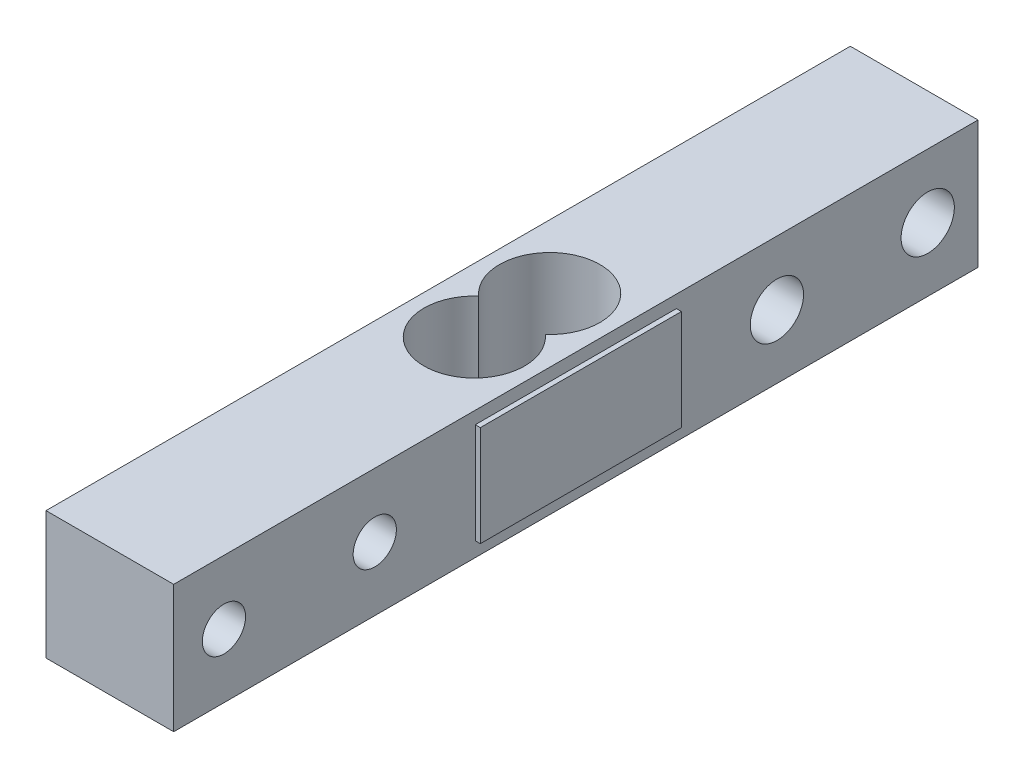
ISO-10303-21;
HEADER;
FILE_DESCRIPTION(('STEP AP214'),'2;1');
FILE_NAME('part.step','',(''),(''),'','','');
FILE_SCHEMA(('AUTOMOTIVE_DESIGN { 1 0 10303 214 1 1 1 1 }'));
ENDSEC;
DATA;
#1=APPLICATION_CONTEXT('core data for automotive mechanical design processes');
#2=APPLICATION_PROTOCOL_DEFINITION('international standard','automotive_design',2000,#1);
#3=PRODUCT_CONTEXT('',#1,'mechanical');
#4=PRODUCT('Part','Part','',(#3));
#5=PRODUCT_RELATED_PRODUCT_CATEGORY('part','',(#4));
#6=PRODUCT_DEFINITION_FORMATION('','',#4);
#7=PRODUCT_DEFINITION_CONTEXT('part definition',#1,'design');
#8=PRODUCT_DEFINITION('design','',#6,#7);
#9=PRODUCT_DEFINITION_SHAPE('','',#8);
#10=(LENGTH_UNIT() NAMED_UNIT(*) SI_UNIT(.MILLI.,.METRE.));
#11=(NAMED_UNIT(*) PLANE_ANGLE_UNIT() SI_UNIT($,.RADIAN.));
#12=(NAMED_UNIT(*) SI_UNIT($,.STERADIAN.) SOLID_ANGLE_UNIT());
#13=UNCERTAINTY_MEASURE_WITH_UNIT(LENGTH_MEASURE(1.E-05),#10,'distance_accuracy_value','');
#14=(GEOMETRIC_REPRESENTATION_CONTEXT(3) GLOBAL_UNCERTAINTY_ASSIGNED_CONTEXT((#13)) GLOBAL_UNIT_ASSIGNED_CONTEXT((#10,
#11,#12)) REPRESENTATION_CONTEXT('',''));
#15=CARTESIAN_POINT('',(0.,0.,0.));
#16=DIRECTION('',(0.,0.,1.));
#17=DIRECTION('',(1.,0.,0.));
#18=AXIS2_PLACEMENT_3D('',#15,#16,#17);
#19=CARTESIAN_POINT('',(12.7,0.,0.));
#20=DIRECTION('',(1.,0.,0.));
#21=DIRECTION('',(0.,0.,-1.));
#22=AXIS2_PLACEMENT_3D('',#19,#20,#21);
#23=PLANE('',#22);
#24=CARTESIAN_POINT('',(12.7,0.,35.));
#25=DIRECTION('',(1.,0.,0.));
#26=DIRECTION('',(0.,0.,-1.));
#27=AXIS2_PLACEMENT_3D('',#24,#25,#26);
#28=CIRCLE('',#27,2.15);
#29=CARTESIAN_POINT('',(12.7,0.,32.85));
#30=VERTEX_POINT('',#29);
#31=EDGE_CURVE('E240',#30,#30,#28,.T.);
#32=ORIENTED_EDGE('',*,*,#31,.F.);
#33=EDGE_LOOP('',(#32));
#34=FACE_BOUND('',#33,.T.);
#35=CARTESIAN_POINT('',(12.7,0.,20.));
#36=DIRECTION('',(1.,0.,0.));
#37=DIRECTION('',(0.,0.,-1.));
#38=AXIS2_PLACEMENT_3D('',#35,#36,#37);
#39=CIRCLE('',#38,2.15);
#40=CARTESIAN_POINT('',(12.7,0.,17.85));
#41=VERTEX_POINT('',#40);
#42=EDGE_CURVE('E248',#41,#41,#39,.T.);
#43=ORIENTED_EDGE('',*,*,#42,.F.);
#44=EDGE_LOOP('',(#43));
#45=FACE_BOUND('',#44,.T.);
#46=CARTESIAN_POINT('',(12.7,0.,-20.));
#47=DIRECTION('',(1.,0.,0.));
#48=DIRECTION('',(0.,0.,-1.));
#49=AXIS2_PLACEMENT_3D('',#46,#47,#48);
#50=CIRCLE('',#49,2.65);
#51=CARTESIAN_POINT('',(12.7,0.,-22.65));
#52=VERTEX_POINT('',#51);
#53=EDGE_CURVE('E256',#52,#52,#50,.T.);
#54=ORIENTED_EDGE('',*,*,#53,.F.);
#55=EDGE_LOOP('',(#54));
#56=FACE_BOUND('',#55,.T.);
#57=CARTESIAN_POINT('',(12.7,0.,-35.));
#58=DIRECTION('',(1.,0.,0.));
#59=DIRECTION('',(0.,0.,-1.));
#60=AXIS2_PLACEMENT_3D('',#57,#58,#59);
#61=CIRCLE('',#60,2.65);
#62=CARTESIAN_POINT('',(12.7,0.,-37.65));
#63=VERTEX_POINT('',#62);
#64=EDGE_CURVE('E226',#63,#63,#61,.T.);
#65=ORIENTED_EDGE('',*,*,#64,.F.);
#66=EDGE_LOOP('',(#65));
#67=FACE_BOUND('',#66,.T.);
#68=DIRECTION('',(0.,-1.,0.));
#69=VECTOR('',#68,1.);
#70=CARTESIAN_POINT('',(12.7,-6.35,40.));
#71=LINE('',#70,#69);
#72=CARTESIAN_POINT('',(12.7,6.34999999999999,40.));
#73=VERTEX_POINT('',#72);
#74=CARTESIAN_POINT('',(12.7,-6.35,40.));
#75=VERTEX_POINT('',#74);
#76=EDGE_CURVE('E289',#73,#75,#71,.T.);
#77=ORIENTED_EDGE('',*,*,#76,.T.);
#78=DIRECTION('',(0.,0.,-1.));
#79=VECTOR('',#78,1.);
#80=CARTESIAN_POINT('',(12.7,-6.34999999999999,-40.));
#81=LINE('',#80,#79);
#82=CARTESIAN_POINT('',(12.7,-6.34999999999999,-40.));
#83=VERTEX_POINT('',#82);
#84=EDGE_CURVE('E293',#75,#83,#81,.T.);
#85=ORIENTED_EDGE('',*,*,#84,.T.);
#86=DIRECTION('',(0.,1.,0.));
#87=VECTOR('',#86,1.);
#88=CARTESIAN_POINT('',(12.7,-6.34999999999999,-40.));
#89=LINE('',#88,#87);
#90=CARTESIAN_POINT('',(12.7,6.35,-40.));
#91=VERTEX_POINT('',#90);
#92=EDGE_CURVE('E297',#83,#91,#89,.T.);
#93=ORIENTED_EDGE('',*,*,#92,.T.);
#94=DIRECTION('',(0.,0.,1.));
#95=VECTOR('',#94,1.);
#96=CARTESIAN_POINT('',(12.7,6.35,-40.));
#97=LINE('',#96,#95);
#98=EDGE_CURVE('E300',#91,#73,#97,.T.);
#99=ORIENTED_EDGE('',*,*,#98,.T.);
#100=EDGE_LOOP('',(#77,#85,#93,#99));
#101=FACE_BOUND('',#100,.T.);
#102=DIRECTION('',(0.,1.,0.));
#103=VECTOR('',#102,1.);
#104=CARTESIAN_POINT('',(12.7,-4.9,-9.99999999999999));
#105=LINE('',#104,#103);
#106=CARTESIAN_POINT('',(12.7,-4.9,-9.99999999999999));
#107=VERTEX_POINT('',#106);
#108=CARTESIAN_POINT('',(12.7,5.1,-9.99999999999999));
#109=VERTEX_POINT('',#108);
#110=EDGE_CURVE('E56',#107,#109,#105,.T.);
#111=ORIENTED_EDGE('',*,*,#110,.F.);
#112=DIRECTION('',(0.,0.,1.));
#113=VECTOR('',#112,1.);
#114=CARTESIAN_POINT('',(12.7,-4.9,10.));
#115=LINE('',#114,#113);
#116=CARTESIAN_POINT('',(12.7,-4.9,10.));
#117=VERTEX_POINT('',#116);
#118=EDGE_CURVE('E60',#107,#117,#115,.T.);
#119=ORIENTED_EDGE('',*,*,#118,.T.);
#120=DIRECTION('',(0.,1.,0.));
#121=VECTOR('',#120,1.);
#122=CARTESIAN_POINT('',(12.7,-4.9,10.));
#123=LINE('',#122,#121);
#124=CARTESIAN_POINT('',(12.7,5.1,10.));
#125=VERTEX_POINT('',#124);
#126=EDGE_CURVE('E153',#117,#125,#123,.T.);
#127=ORIENTED_EDGE('',*,*,#126,.T.);
#128=DIRECTION('',(0.,0.,1.));
#129=VECTOR('',#128,1.);
#130=CARTESIAN_POINT('',(12.7,5.1,10.));
#131=LINE('',#130,#129);
#132=EDGE_CURVE('E172',#109,#125,#131,.T.);
#133=ORIENTED_EDGE('',*,*,#132,.F.);
#134=EDGE_LOOP('',(#111,#119,#127,#133));
#135=FACE_BOUND('',#134,.T.);
#136=ADVANCED_FACE('F40',(#34,#45,#56,#67,#101,#135),#23,.T.);
#137=CARTESIAN_POINT('',(12.7,-6.35,40.));
#138=DIRECTION('',(0.,0.,-1.));
#139=DIRECTION('',(-1.,0.,0.));
#140=AXIS2_PLACEMENT_3D('',#137,#138,#139);
#141=PLANE('',#140);
#142=DIRECTION('',(0.,-1.,0.));
#143=VECTOR('',#142,1.);
#144=CARTESIAN_POINT('',(0.,-6.35,40.));
#145=LINE('',#144,#143);
#146=CARTESIAN_POINT('',(0.,6.34999999999999,40.));
#147=VERTEX_POINT('',#146);
#148=CARTESIAN_POINT('',(0.,-6.35,40.));
#149=VERTEX_POINT('',#148);
#150=EDGE_CURVE('E285',#147,#149,#145,.T.);
#151=ORIENTED_EDGE('',*,*,#150,.T.);
#152=DIRECTION('',(-1.,0.,0.));
#153=VECTOR('',#152,1.);
#154=CARTESIAN_POINT('',(12.7,-6.35,40.));
#155=LINE('',#154,#153);
#156=EDGE_CURVE('E11',#75,#149,#155,.T.);
#157=ORIENTED_EDGE('',*,*,#156,.F.);
#158=ORIENTED_EDGE('',*,*,#76,.F.);
#159=DIRECTION('',(-1.,0.,0.));
#160=VECTOR('',#159,1.);
#161=CARTESIAN_POINT('',(12.7,6.34999999999999,40.));
#162=LINE('',#161,#160);
#163=EDGE_CURVE('E303',#73,#147,#162,.T.);
#164=ORIENTED_EDGE('',*,*,#163,.T.);
#165=EDGE_LOOP('',(#151,#157,#158,#164));
#166=FACE_BOUND('',#165,.T.);
#167=ADVANCED_FACE('F42',(#166),#141,.F.);
#168=CARTESIAN_POINT('',(12.7,-6.34999999999999,-40.));
#169=DIRECTION('',(0.,1.,0.));
#170=DIRECTION('',(0.,0.,1.));
#171=AXIS2_PLACEMENT_3D('',#168,#169,#170);
#172=PLANE('',#171);
#173=CARTESIAN_POINT('',(6.35,-6.35000000000001,3.75));
#174=DIRECTION('',(0.,1.,0.));
#175=DIRECTION('',(0.,0.,1.));
#176=AXIS2_PLACEMENT_3D('',#173,#174,#175);
#177=CIRCLE('',#176,5.);
#178=CARTESIAN_POINT('',(3.04281086116927,-6.35000000000001,0.));
#179=VERTEX_POINT('',#178);
#180=CARTESIAN_POINT('',(9.65718913883074,-6.35,0.));
#181=VERTEX_POINT('',#180);
#182=EDGE_CURVE('E271',#179,#181,#177,.T.);
#183=ORIENTED_EDGE('',*,*,#182,.T.);
#184=CARTESIAN_POINT('',(6.35,-6.35000000000001,-3.75));
#185=DIRECTION('',(0.,1.,0.));
#186=DIRECTION('',(0.,0.,1.));
#187=AXIS2_PLACEMENT_3D('',#184,#185,#186);
#188=CIRCLE('',#187,5.);
#189=EDGE_CURVE('E267',#181,#179,#188,.T.);
#190=ORIENTED_EDGE('',*,*,#189,.T.);
#191=EDGE_LOOP('',(#183,#190));
#192=FACE_BOUND('',#191,.T.);
#193=DIRECTION('',(0.,0.,-1.));
#194=VECTOR('',#193,1.);
#195=CARTESIAN_POINT('',(0.,-6.34999999999999,-40.));
#196=LINE('',#195,#194);
#197=CARTESIAN_POINT('',(0.,-6.34999999999999,-40.));
#198=VERTEX_POINT('',#197);
#199=EDGE_CURVE('E307',#149,#198,#196,.T.);
#200=ORIENTED_EDGE('',*,*,#199,.T.);
#201=DIRECTION('',(-1.,0.,0.));
#202=VECTOR('',#201,1.);
#203=CARTESIAN_POINT('',(12.7,-6.34999999999999,-40.));
#204=LINE('',#203,#202);
#205=EDGE_CURVE('E49',#83,#198,#204,.T.);
#206=ORIENTED_EDGE('',*,*,#205,.F.);
#207=ORIENTED_EDGE('',*,*,#84,.F.);
#208=ORIENTED_EDGE('',*,*,#156,.T.);
#209=EDGE_LOOP('',(#200,#206,#207,#208));
#210=FACE_BOUND('',#209,.T.);
#211=ADVANCED_FACE('F342',(#192,#210),#172,.F.);
#212=CARTESIAN_POINT('',(12.7,-6.34999999999999,-40.));
#213=DIRECTION('',(0.,0.,1.));
#214=DIRECTION('',(1.,0.,0.));
#215=AXIS2_PLACEMENT_3D('',#212,#213,#214);
#216=PLANE('',#215);
#217=DIRECTION('',(0.,1.,0.));
#218=VECTOR('',#217,1.);
#219=CARTESIAN_POINT('',(0.,-6.34999999999999,-40.));
#220=LINE('',#219,#218);
#221=CARTESIAN_POINT('',(0.,6.35,-40.));
#222=VERTEX_POINT('',#221);
#223=EDGE_CURVE('E310',#198,#222,#220,.T.);
#224=ORIENTED_EDGE('',*,*,#223,.T.);
#225=DIRECTION('',(-1.,0.,0.));
#226=VECTOR('',#225,1.);
#227=CARTESIAN_POINT('',(12.7,6.35,-40.));
#228=LINE('',#227,#226);
#229=EDGE_CURVE('E318',#91,#222,#228,.T.);
#230=ORIENTED_EDGE('',*,*,#229,.F.);
#231=ORIENTED_EDGE('',*,*,#92,.F.);
#232=ORIENTED_EDGE('',*,*,#205,.T.);
#233=EDGE_LOOP('',(#224,#230,#231,#232));
#234=FACE_BOUND('',#233,.T.);
#235=ADVANCED_FACE('F327',(#234),#216,.F.);
#236=CARTESIAN_POINT('',(12.7,6.35,-40.));
#237=DIRECTION('',(0.,-1.,0.));
#238=DIRECTION('',(0.,0.,-1.));
#239=AXIS2_PLACEMENT_3D('',#236,#237,#238);
#240=PLANE('',#239);
#241=CARTESIAN_POINT('',(6.35,6.35,3.75));
#242=DIRECTION('',(0.,1.,0.));
#243=DIRECTION('',(0.,0.,1.));
#244=AXIS2_PLACEMENT_3D('',#241,#242,#243);
#245=CIRCLE('',#244,5.);
#246=CARTESIAN_POINT('',(3.04281086116927,6.35,0.));
#247=VERTEX_POINT('',#246);
#248=CARTESIAN_POINT('',(9.65718913883074,6.35,0.));
#249=VERTEX_POINT('',#248);
#250=EDGE_CURVE('E272',#247,#249,#245,.T.);
#251=ORIENTED_EDGE('',*,*,#250,.F.);
#252=CARTESIAN_POINT('',(6.35,6.35,-3.75));
#253=DIRECTION('',(0.,1.,0.));
#254=DIRECTION('',(0.,0.,1.));
#255=AXIS2_PLACEMENT_3D('',#252,#253,#254);
#256=CIRCLE('',#255,5.);
#257=EDGE_CURVE('E239',#249,#247,#256,.T.);
#258=ORIENTED_EDGE('',*,*,#257,.F.);
#259=EDGE_LOOP('',(#251,#258));
#260=FACE_BOUND('',#259,.T.);
#261=DIRECTION('',(0.,0.,1.));
#262=VECTOR('',#261,1.);
#263=CARTESIAN_POINT('',(0.,6.35,-40.));
#264=LINE('',#263,#262);
#265=EDGE_CURVE('E294',#222,#147,#264,.T.);
#266=ORIENTED_EDGE('',*,*,#265,.T.);
#267=ORIENTED_EDGE('',*,*,#163,.F.);
#268=ORIENTED_EDGE('',*,*,#98,.F.);
#269=ORIENTED_EDGE('',*,*,#229,.T.);
#270=EDGE_LOOP('',(#266,#267,#268,#269));
#271=FACE_BOUND('',#270,.T.);
#272=ADVANCED_FACE('F336',(#260,#271),#240,.F.);
#273=CARTESIAN_POINT('',(0.,0.,0.));
#274=DIRECTION('',(1.,0.,0.));
#275=DIRECTION('',(0.,0.,-1.));
#276=AXIS2_PLACEMENT_3D('',#273,#274,#275);
#277=PLANE('',#276);
#278=DIRECTION('',(0.,1.,0.));
#279=VECTOR('',#278,1.);
#280=CARTESIAN_POINT('',(0.,-4.9,10.));
#281=LINE('',#280,#279);
#282=CARTESIAN_POINT('',(0.,-4.9,10.));
#283=VERTEX_POINT('',#282);
#284=CARTESIAN_POINT('',(0.,5.1,10.));
#285=VERTEX_POINT('',#284);
#286=EDGE_CURVE('E222',#283,#285,#281,.T.);
#287=ORIENTED_EDGE('',*,*,#286,.F.);
#288=DIRECTION('',(0.,0.,-1.));
#289=VECTOR('',#288,1.);
#290=CARTESIAN_POINT('',(0.,-4.9,10.));
#291=LINE('',#290,#289);
#292=CARTESIAN_POINT('',(0.,-4.9,-9.99999999999997));
#293=VERTEX_POINT('',#292);
#294=EDGE_CURVE('E191',#283,#293,#291,.T.);
#295=ORIENTED_EDGE('',*,*,#294,.T.);
#296=DIRECTION('',(0.,1.,0.));
#297=VECTOR('',#296,1.);
#298=CARTESIAN_POINT('',(0.,-4.9,-9.99999999999997));
#299=LINE('',#298,#297);
#300=CARTESIAN_POINT('',(0.,5.1,-9.99999999999997));
#301=VERTEX_POINT('',#300);
#302=EDGE_CURVE('E207',#293,#301,#299,.T.);
#303=ORIENTED_EDGE('',*,*,#302,.T.);
#304=DIRECTION('',(0.,0.,-1.));
#305=VECTOR('',#304,1.);
#306=CARTESIAN_POINT('',(0.,5.1,10.));
#307=LINE('',#306,#305);
#308=EDGE_CURVE('E186',#285,#301,#307,.T.);
#309=ORIENTED_EDGE('',*,*,#308,.F.);
#310=EDGE_LOOP('',(#287,#295,#303,#309));
#311=FACE_BOUND('',#310,.T.);
#312=CARTESIAN_POINT('',(0.,0.,35.));
#313=DIRECTION('',(1.,0.,0.));
#314=DIRECTION('',(0.,0.,-1.));
#315=AXIS2_PLACEMENT_3D('',#312,#313,#314);
#316=CIRCLE('',#315,2.15);
#317=CARTESIAN_POINT('',(0.,0.,32.85));
#318=VERTEX_POINT('',#317);
#319=EDGE_CURVE('E235',#318,#318,#316,.T.);
#320=ORIENTED_EDGE('',*,*,#319,.T.);
#321=EDGE_LOOP('',(#320));
#322=FACE_BOUND('',#321,.T.);
#323=CARTESIAN_POINT('',(0.,0.,20.));
#324=DIRECTION('',(1.,0.,0.));
#325=DIRECTION('',(0.,0.,-1.));
#326=AXIS2_PLACEMENT_3D('',#323,#324,#325);
#327=CIRCLE('',#326,2.15);
#328=CARTESIAN_POINT('',(0.,0.,17.85));
#329=VERTEX_POINT('',#328);
#330=EDGE_CURVE('E244',#329,#329,#327,.T.);
#331=ORIENTED_EDGE('',*,*,#330,.T.);
#332=EDGE_LOOP('',(#331));
#333=FACE_BOUND('',#332,.T.);
#334=CARTESIAN_POINT('',(0.,0.,-20.));
#335=DIRECTION('',(1.,0.,0.));
#336=DIRECTION('',(0.,0.,-1.));
#337=AXIS2_PLACEMENT_3D('',#334,#335,#336);
#338=CIRCLE('',#337,2.65);
#339=CARTESIAN_POINT('',(0.,0.,-22.65));
#340=VERTEX_POINT('',#339);
#341=EDGE_CURVE('E252',#340,#340,#338,.T.);
#342=ORIENTED_EDGE('',*,*,#341,.T.);
#343=EDGE_LOOP('',(#342));
#344=FACE_BOUND('',#343,.T.);
#345=CARTESIAN_POINT('',(0.,0.,-35.));
#346=DIRECTION('',(1.,0.,0.));
#347=DIRECTION('',(0.,0.,-1.));
#348=AXIS2_PLACEMENT_3D('',#345,#346,#347);
#349=CIRCLE('',#348,2.65);
#350=CARTESIAN_POINT('',(0.,0.,-37.65));
#351=VERTEX_POINT('',#350);
#352=EDGE_CURVE('E260',#351,#351,#349,.T.);
#353=ORIENTED_EDGE('',*,*,#352,.T.);
#354=EDGE_LOOP('',(#353));
#355=FACE_BOUND('',#354,.T.);
#356=ORIENTED_EDGE('',*,*,#150,.F.);
#357=ORIENTED_EDGE('',*,*,#265,.F.);
#358=ORIENTED_EDGE('',*,*,#223,.F.);
#359=ORIENTED_EDGE('',*,*,#199,.F.);
#360=EDGE_LOOP('',(#356,#357,#358,#359));
#361=FACE_BOUND('',#360,.T.);
#362=ADVANCED_FACE('F333',(#311,#322,#333,#344,#355,#361),#277,.F.);
#363=CARTESIAN_POINT('',(6.35,-6.35000000000001,-3.75));
#364=DIRECTION('',(0.,1.,0.));
#365=DIRECTION('',(0.,0.,1.));
#366=AXIS2_PLACEMENT_3D('',#363,#364,#365);
#367=CYLINDRICAL_SURFACE('',#366,5.);
#368=ORIENTED_EDGE('',*,*,#257,.T.);
#369=DIRECTION('',(0.,1.,0.));
#370=VECTOR('',#369,1.);
#371=CARTESIAN_POINT('',(3.04281086116927,-6.35000000000001,0.));
#372=LINE('',#371,#370);
#373=EDGE_CURVE('E276',#179,#247,#372,.T.);
#374=ORIENTED_EDGE('',*,*,#373,.F.);
#375=ORIENTED_EDGE('',*,*,#189,.F.);
#376=DIRECTION('',(0.,1.,0.));
#377=VECTOR('',#376,1.);
#378=CARTESIAN_POINT('',(9.65718913883074,-6.35000000000001,0.));
#379=LINE('',#378,#377);
#380=EDGE_CURVE('E282',#181,#249,#379,.T.);
#381=ORIENTED_EDGE('',*,*,#380,.T.);
#382=EDGE_LOOP('',(#368,#374,#375,#381));
#383=FACE_BOUND('',#382,.T.);
#384=ADVANCED_FACE('F359',(#383),#367,.F.);
#385=CARTESIAN_POINT('',(6.35,-6.35000000000001,3.75));
#386=DIRECTION('',(0.,1.,0.));
#387=DIRECTION('',(0.,0.,1.));
#388=AXIS2_PLACEMENT_3D('',#385,#386,#387);
#389=CYLINDRICAL_SURFACE('',#388,5.);
#390=ORIENTED_EDGE('',*,*,#250,.T.);
#391=ORIENTED_EDGE('',*,*,#380,.F.);
#392=ORIENTED_EDGE('',*,*,#182,.F.);
#393=ORIENTED_EDGE('',*,*,#373,.T.);
#394=EDGE_LOOP('',(#390,#391,#392,#393));
#395=FACE_BOUND('',#394,.T.);
#396=ADVANCED_FACE('F372',(#395),#389,.F.);
#397=CARTESIAN_POINT('',(0.,0.,-35.));
#398=DIRECTION('',(1.,0.,0.));
#399=DIRECTION('',(0.,0.,-1.));
#400=AXIS2_PLACEMENT_3D('',#397,#398,#399);
#401=CYLINDRICAL_SURFACE('',#400,2.65);
#402=ORIENTED_EDGE('',*,*,#352,.F.);
#403=EDGE_LOOP('',(#402));
#404=FACE_BOUND('',#403,.T.);
#405=ORIENTED_EDGE('',*,*,#64,.T.);
#406=EDGE_LOOP('',(#405));
#407=FACE_BOUND('',#406,.T.);
#408=ADVANCED_FACE('F379',(#404,#407),#401,.F.);
#409=CARTESIAN_POINT('',(0.,0.,-20.));
#410=DIRECTION('',(1.,0.,0.));
#411=DIRECTION('',(0.,0.,-1.));
#412=AXIS2_PLACEMENT_3D('',#409,#410,#411);
#413=CYLINDRICAL_SURFACE('',#412,2.65);
#414=ORIENTED_EDGE('',*,*,#341,.F.);
#415=EDGE_LOOP('',(#414));
#416=FACE_BOUND('',#415,.T.);
#417=ORIENTED_EDGE('',*,*,#53,.T.);
#418=EDGE_LOOP('',(#417));
#419=FACE_BOUND('',#418,.T.);
#420=ADVANCED_FACE('F383',(#416,#419),#413,.F.);
#421=CARTESIAN_POINT('',(0.,0.,20.));
#422=DIRECTION('',(1.,0.,0.));
#423=DIRECTION('',(0.,0.,-1.));
#424=AXIS2_PLACEMENT_3D('',#421,#422,#423);
#425=CYLINDRICAL_SURFACE('',#424,2.15);
#426=ORIENTED_EDGE('',*,*,#330,.F.);
#427=EDGE_LOOP('',(#426));
#428=FACE_BOUND('',#427,.T.);
#429=ORIENTED_EDGE('',*,*,#42,.T.);
#430=EDGE_LOOP('',(#429));
#431=FACE_BOUND('',#430,.T.);
#432=ADVANCED_FACE('F389',(#428,#431),#425,.F.);
#433=CARTESIAN_POINT('',(0.,0.,35.));
#434=DIRECTION('',(1.,0.,0.));
#435=DIRECTION('',(0.,0.,-1.));
#436=AXIS2_PLACEMENT_3D('',#433,#434,#435);
#437=CYLINDRICAL_SURFACE('',#436,2.15);
#438=ORIENTED_EDGE('',*,*,#319,.F.);
#439=EDGE_LOOP('',(#438));
#440=FACE_BOUND('',#439,.T.);
#441=ORIENTED_EDGE('',*,*,#31,.T.);
#442=EDGE_LOOP('',(#441));
#443=FACE_BOUND('',#442,.T.);
#444=ADVANCED_FACE('F393',(#440,#443),#437,.F.);
#445=CARTESIAN_POINT('',(-0.500000000000003,-4.9,10.));
#446=DIRECTION('',(0.,0.,1.));
#447=DIRECTION('',(0.,-1.,0.));
#448=AXIS2_PLACEMENT_3D('',#445,#446,#447);
#449=PLANE('',#448);
#450=DIRECTION('',(1.,0.,0.));
#451=VECTOR('',#450,1.);
#452=CARTESIAN_POINT('',(-0.500000000000003,5.1,10.));
#453=LINE('',#452,#451);
#454=CARTESIAN_POINT('',(-0.500000000000003,5.1,10.));
#455=VERTEX_POINT('',#454);
#456=EDGE_CURVE('E195',#455,#285,#453,.T.);
#457=ORIENTED_EDGE('',*,*,#456,.F.);
#458=DIRECTION('',(0.,1.,0.));
#459=VECTOR('',#458,1.);
#460=CARTESIAN_POINT('',(-0.500000000000003,-4.9,10.));
#461=LINE('',#460,#459);
#462=CARTESIAN_POINT('',(-0.500000000000003,-4.9,10.));
#463=VERTEX_POINT('',#462);
#464=EDGE_CURVE('E227',#463,#455,#461,.T.);
#465=ORIENTED_EDGE('',*,*,#464,.F.);
#466=DIRECTION('',(1.,0.,0.));
#467=VECTOR('',#466,1.);
#468=CARTESIAN_POINT('',(-0.500000000000003,-4.9,10.));
#469=LINE('',#468,#467);
#470=EDGE_CURVE('E203',#463,#283,#469,.T.);
#471=ORIENTED_EDGE('',*,*,#470,.T.);
#472=ORIENTED_EDGE('',*,*,#286,.T.);
#473=EDGE_LOOP('',(#457,#465,#471,#472));
#474=FACE_BOUND('',#473,.T.);
#475=ADVANCED_FACE('F397',(#474),#449,.T.);
#476=CARTESIAN_POINT('',(-0.500000000000003,-4.9,10.));
#477=DIRECTION('',(-1.,0.,0.));
#478=DIRECTION('',(0.,0.,1.));
#479=AXIS2_PLACEMENT_3D('',#476,#477,#478);
#480=PLANE('',#479);
#481=DIRECTION('',(0.,0.,1.));
#482=VECTOR('',#481,1.);
#483=CARTESIAN_POINT('',(-0.500000000000003,5.1,10.));
#484=LINE('',#483,#482);
#485=CARTESIAN_POINT('',(-0.5,5.1,-9.99999999999997));
#486=VERTEX_POINT('',#485);
#487=EDGE_CURVE('E215',#486,#455,#484,.T.);
#488=ORIENTED_EDGE('',*,*,#487,.F.);
#489=DIRECTION('',(0.,1.,0.));
#490=VECTOR('',#489,1.);
#491=CARTESIAN_POINT('',(-0.5,-4.9,-9.99999999999997));
#492=LINE('',#491,#490);
#493=CARTESIAN_POINT('',(-0.5,-4.9,-9.99999999999997));
#494=VERTEX_POINT('',#493);
#495=EDGE_CURVE('E230',#494,#486,#492,.T.);
#496=ORIENTED_EDGE('',*,*,#495,.F.);
#497=DIRECTION('',(0.,0.,1.));
#498=VECTOR('',#497,1.);
#499=CARTESIAN_POINT('',(-0.500000000000003,-4.9,10.));
#500=LINE('',#499,#498);
#501=EDGE_CURVE('E199',#494,#463,#500,.T.);
#502=ORIENTED_EDGE('',*,*,#501,.T.);
#503=ORIENTED_EDGE('',*,*,#464,.T.);
#504=EDGE_LOOP('',(#488,#496,#502,#503));
#505=FACE_BOUND('',#504,.T.);
#506=ADVANCED_FACE('F403',(#505),#480,.T.);
#507=CARTESIAN_POINT('',(-0.5,-4.9,-9.99999999999997));
#508=DIRECTION('',(0.,0.,-1.));
#509=DIRECTION('',(0.,1.,0.));
#510=AXIS2_PLACEMENT_3D('',#507,#508,#509);
#511=PLANE('',#510);
#512=DIRECTION('',(-1.,0.,0.));
#513=VECTOR('',#512,1.);
#514=CARTESIAN_POINT('',(-0.5,5.1,-9.99999999999997));
#515=LINE('',#514,#513);
#516=EDGE_CURVE('E211',#301,#486,#515,.T.);
#517=ORIENTED_EDGE('',*,*,#516,.F.);
#518=ORIENTED_EDGE('',*,*,#302,.F.);
#519=DIRECTION('',(-1.,0.,0.));
#520=VECTOR('',#519,1.);
#521=CARTESIAN_POINT('',(-0.5,-4.9,-9.99999999999997));
#522=LINE('',#521,#520);
#523=EDGE_CURVE('E194',#293,#494,#522,.T.);
#524=ORIENTED_EDGE('',*,*,#523,.T.);
#525=ORIENTED_EDGE('',*,*,#495,.T.);
#526=EDGE_LOOP('',(#517,#518,#524,#525));
#527=FACE_BOUND('',#526,.T.);
#528=ADVANCED_FACE('F399',(#527),#511,.T.);
#529=CARTESIAN_POINT('',(0.,-4.9,0.));
#530=DIRECTION('',(0.,-1.,0.));
#531=DIRECTION('',(0.,0.,-1.));
#532=AXIS2_PLACEMENT_3D('',#529,#530,#531);
#533=PLANE('',#532);
#534=ORIENTED_EDGE('',*,*,#294,.F.);
#535=ORIENTED_EDGE('',*,*,#470,.F.);
#536=ORIENTED_EDGE('',*,*,#501,.F.);
#537=ORIENTED_EDGE('',*,*,#523,.F.);
#538=EDGE_LOOP('',(#534,#535,#536,#537));
#539=FACE_BOUND('',#538,.T.);
#540=ADVANCED_FACE('F402',(#539),#533,.T.);
#541=CARTESIAN_POINT('',(0.,5.1,0.));
#542=DIRECTION('',(0.,-1.,0.));
#543=DIRECTION('',(0.,0.,-1.));
#544=AXIS2_PLACEMENT_3D('',#541,#542,#543);
#545=PLANE('',#544);
#546=ORIENTED_EDGE('',*,*,#308,.T.);
#547=ORIENTED_EDGE('',*,*,#516,.T.);
#548=ORIENTED_EDGE('',*,*,#487,.T.);
#549=ORIENTED_EDGE('',*,*,#456,.T.);
#550=EDGE_LOOP('',(#546,#547,#548,#549));
#551=FACE_BOUND('',#550,.T.);
#552=ADVANCED_FACE('F411',(#551),#545,.F.);
#553=CARTESIAN_POINT('',(13.2,-4.9,-9.99999999999999));
#554=DIRECTION('',(0.,0.,-1.));
#555=DIRECTION('',(0.,1.,0.));
#556=AXIS2_PLACEMENT_3D('',#553,#554,#555);
#557=PLANE('',#556);
#558=DIRECTION('',(-1.,0.,0.));
#559=VECTOR('',#558,1.);
#560=CARTESIAN_POINT('',(13.2,5.1,-9.99999999999999));
#561=LINE('',#560,#559);
#562=CARTESIAN_POINT('',(13.2,5.1,-9.99999999999999));
#563=VERTEX_POINT('',#562);
#564=EDGE_CURVE('E167',#563,#109,#561,.T.);
#565=ORIENTED_EDGE('',*,*,#564,.F.);
#566=DIRECTION('',(0.,1.,0.));
#567=VECTOR('',#566,1.);
#568=CARTESIAN_POINT('',(13.2,-4.9,-9.99999999999999));
#569=LINE('',#568,#567);
#570=CARTESIAN_POINT('',(13.2,-4.9,-9.99999999999999));
#571=VERTEX_POINT('',#570);
#572=EDGE_CURVE('E152',#571,#563,#569,.T.);
#573=ORIENTED_EDGE('',*,*,#572,.F.);
#574=DIRECTION('',(-1.,0.,0.));
#575=VECTOR('',#574,1.);
#576=CARTESIAN_POINT('',(13.2,-4.9,-9.99999999999999));
#577=LINE('',#576,#575);
#578=EDGE_CURVE('E160',#571,#107,#577,.T.);
#579=ORIENTED_EDGE('',*,*,#578,.T.);
#580=ORIENTED_EDGE('',*,*,#110,.T.);
#581=EDGE_LOOP('',(#565,#573,#579,#580));
#582=FACE_BOUND('',#581,.T.);
#583=ADVANCED_FACE('F414',(#582),#557,.T.);
#584=CARTESIAN_POINT('',(13.2,-4.9,10.));
#585=DIRECTION('',(1.,0.,0.));
#586=DIRECTION('',(0.,0.,-1.));
#587=AXIS2_PLACEMENT_3D('',#584,#585,#586);
#588=PLANE('',#587);
#589=DIRECTION('',(0.,0.,-1.));
#590=VECTOR('',#589,1.);
#591=CARTESIAN_POINT('',(13.2,5.1,10.));
#592=LINE('',#591,#590);
#593=CARTESIAN_POINT('',(13.2,5.1,10.));
#594=VERTEX_POINT('',#593);
#595=EDGE_CURVE('E146',#594,#563,#592,.T.);
#596=ORIENTED_EDGE('',*,*,#595,.F.);
#597=DIRECTION('',(0.,1.,0.));
#598=VECTOR('',#597,1.);
#599=CARTESIAN_POINT('',(13.2,-4.9,10.));
#600=LINE('',#599,#598);
#601=CARTESIAN_POINT('',(13.2,-4.9,10.));
#602=VERTEX_POINT('',#601);
#603=EDGE_CURVE('E140',#602,#594,#600,.T.);
#604=ORIENTED_EDGE('',*,*,#603,.F.);
#605=DIRECTION('',(0.,0.,-1.));
#606=VECTOR('',#605,1.);
#607=CARTESIAN_POINT('',(13.2,-4.9,10.));
#608=LINE('',#607,#606);
#609=EDGE_CURVE('E143',#602,#571,#608,.T.);
#610=ORIENTED_EDGE('',*,*,#609,.T.);
#611=ORIENTED_EDGE('',*,*,#572,.T.);
#612=EDGE_LOOP('',(#596,#604,#610,#611));
#613=FACE_BOUND('',#612,.T.);
#614=ADVANCED_FACE('F142',(#613),#588,.T.);
#615=CARTESIAN_POINT('',(13.2,-4.9,10.));
#616=DIRECTION('',(0.,0.,1.));
#617=DIRECTION('',(0.,-1.,0.));
#618=AXIS2_PLACEMENT_3D('',#615,#616,#617);
#619=PLANE('',#618);
#620=DIRECTION('',(1.,0.,0.));
#621=VECTOR('',#620,1.);
#622=CARTESIAN_POINT('',(13.2,5.1,10.));
#623=LINE('',#622,#621);
#624=EDGE_CURVE('E176',#125,#594,#623,.T.);
#625=ORIENTED_EDGE('',*,*,#624,.F.);
#626=ORIENTED_EDGE('',*,*,#126,.F.);
#627=DIRECTION('',(1.,0.,0.));
#628=VECTOR('',#627,1.);
#629=CARTESIAN_POINT('',(13.2,-4.9,10.));
#630=LINE('',#629,#628);
#631=EDGE_CURVE('E158',#117,#602,#630,.T.);
#632=ORIENTED_EDGE('',*,*,#631,.T.);
#633=ORIENTED_EDGE('',*,*,#603,.T.);
#634=EDGE_LOOP('',(#625,#626,#632,#633));
#635=FACE_BOUND('',#634,.T.);
#636=ADVANCED_FACE('F163',(#635),#619,.T.);
#637=CARTESIAN_POINT('',(0.,-4.9,0.));
#638=DIRECTION('',(0.,1.,0.));
#639=DIRECTION('',(0.,0.,1.));
#640=AXIS2_PLACEMENT_3D('',#637,#638,#639);
#641=PLANE('',#640);
#642=ORIENTED_EDGE('',*,*,#118,.F.);
#643=ORIENTED_EDGE('',*,*,#578,.F.);
#644=ORIENTED_EDGE('',*,*,#609,.F.);
#645=ORIENTED_EDGE('',*,*,#631,.F.);
#646=EDGE_LOOP('',(#642,#643,#644,#645));
#647=FACE_BOUND('',#646,.T.);
#648=ADVANCED_FACE('F157',(#647),#641,.F.);
#649=CARTESIAN_POINT('',(0.,5.1,0.));
#650=DIRECTION('',(0.,1.,0.));
#651=DIRECTION('',(0.,0.,1.));
#652=AXIS2_PLACEMENT_3D('',#649,#650,#651);
#653=PLANE('',#652);
#654=ORIENTED_EDGE('',*,*,#132,.T.);
#655=ORIENTED_EDGE('',*,*,#624,.T.);
#656=ORIENTED_EDGE('',*,*,#595,.T.);
#657=ORIENTED_EDGE('',*,*,#564,.T.);
#658=EDGE_LOOP('',(#654,#655,#656,#657));
#659=FACE_BOUND('',#658,.T.);
#660=ADVANCED_FACE('F426',(#659),#653,.T.);
#661=CLOSED_SHELL('',(#136,#167,#211,#235,#272,#362,#384,#396,#408,#420,#432,#444,#475,#506,
#528,#540,#552,#583,#614,#636,#648,#660));
#662=MANIFOLD_SOLID_BREP('B2',#661);
#663=ADVANCED_BREP_SHAPE_REPRESENTATION('',(#18,#662),#14);
#664=SHAPE_DEFINITION_REPRESENTATION(#9,#663);
ENDSEC;
END-ISO-10303-21;
